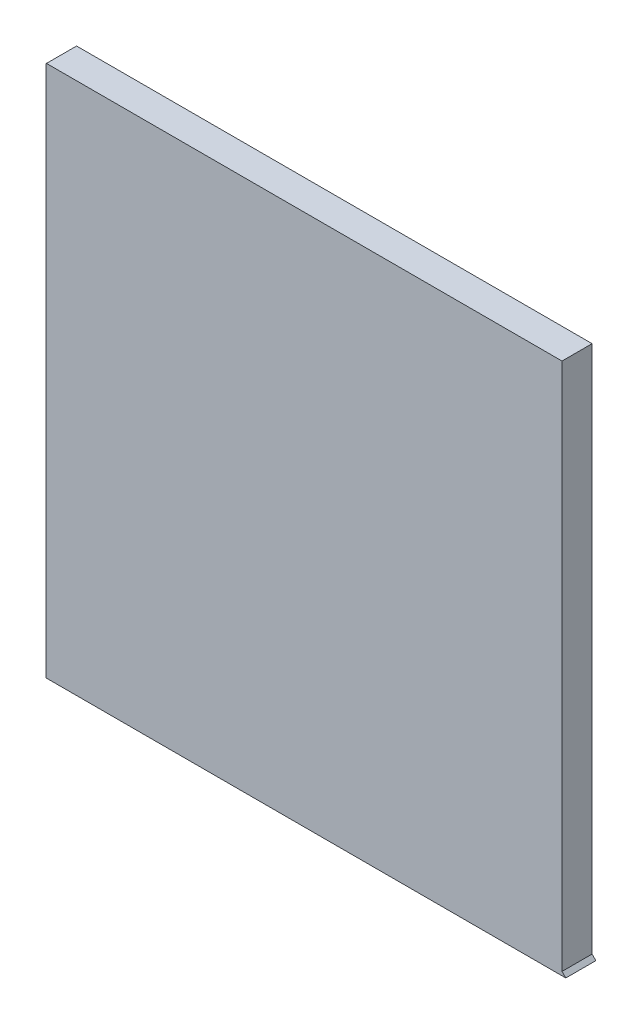
ISO-10303-21;
HEADER;
FILE_DESCRIPTION(('STEP AP214'),'2;1');
FILE_NAME('part.step','',(''),(''),'','','');
FILE_SCHEMA(('AUTOMOTIVE_DESIGN { 1 0 10303 214 1 1 1 1 }'));
ENDSEC;
DATA;
#1=APPLICATION_CONTEXT('core data for automotive mechanical design processes');
#2=APPLICATION_PROTOCOL_DEFINITION('international standard','automotive_design',2000,#1);
#3=PRODUCT_CONTEXT('',#1,'mechanical');
#4=PRODUCT('Part','Part','',(#3));
#5=PRODUCT_RELATED_PRODUCT_CATEGORY('part','',(#4));
#6=PRODUCT_DEFINITION_FORMATION('','',#4);
#7=PRODUCT_DEFINITION_CONTEXT('part definition',#1,'design');
#8=PRODUCT_DEFINITION('design','',#6,#7);
#9=PRODUCT_DEFINITION_SHAPE('','',#8);
#10=(LENGTH_UNIT() NAMED_UNIT(*) SI_UNIT(.MILLI.,.METRE.));
#11=(NAMED_UNIT(*) PLANE_ANGLE_UNIT() SI_UNIT($,.RADIAN.));
#12=(NAMED_UNIT(*) SI_UNIT($,.STERADIAN.) SOLID_ANGLE_UNIT());
#13=UNCERTAINTY_MEASURE_WITH_UNIT(LENGTH_MEASURE(1.E-05),#10,'distance_accuracy_value','');
#14=(GEOMETRIC_REPRESENTATION_CONTEXT(3) GLOBAL_UNCERTAINTY_ASSIGNED_CONTEXT((#13)) GLOBAL_UNIT_ASSIGNED_CONTEXT((#10,
#11,#12)) REPRESENTATION_CONTEXT('',''));
#15=CARTESIAN_POINT('',(0.,0.,0.));
#16=DIRECTION('',(0.,0.,1.));
#17=DIRECTION('',(1.,0.,0.));
#18=AXIS2_PLACEMENT_3D('',#15,#16,#17);
#19=CARTESIAN_POINT('',(-10.358755,10.59688,0.));
#20=DIRECTION('',(-0.707106781187048,0.707106781186048,0.));
#21=DIRECTION('',(0.707106781186048,0.707106781187048,0.));
#22=AXIS2_PLACEMENT_3D('',#19,#20,#21);
#23=PLANE('',#22);
#24=DIRECTION('',(0.,0.,1.));
#25=VECTOR('',#24,1.);
#26=CARTESIAN_POINT('',(-10.358755,10.59688,0.));
#27=LINE('',#26,#25);
#28=CARTESIAN_POINT('',(-10.358755,10.59688,0.));
#29=VERTEX_POINT('',#28);
#30=CARTESIAN_POINT('',(-10.358755,10.59688,1.20000014));
#31=VERTEX_POINT('',#30);
#32=EDGE_CURVE('E11',#29,#31,#27,.T.);
#33=ORIENTED_EDGE('',*,*,#32,.T.);
#34=DIRECTION('',(0.707106781186048,0.707106781187048,0.));
#35=VECTOR('',#34,1.);
#36=CARTESIAN_POINT('',(-10.358755,10.59688,1.20000014));
#37=LINE('',#36,#35);
#38=CARTESIAN_POINT('',(-10.343515,10.61212,1.20000014));
#39=VERTEX_POINT('',#38);
#40=EDGE_CURVE('E25',#31,#39,#37,.T.);
#41=ORIENTED_EDGE('',*,*,#40,.T.);
#42=DIRECTION('',(0.,0.,1.));
#43=VECTOR('',#42,1.);
#44=CARTESIAN_POINT('',(-10.343515,10.61212,0.));
#45=LINE('',#44,#43);
#46=CARTESIAN_POINT('',(-10.343515,10.61212,0.));
#47=VERTEX_POINT('',#46);
#48=EDGE_CURVE('E88',#47,#39,#45,.T.);
#49=ORIENTED_EDGE('',*,*,#48,.F.);
#50=DIRECTION('',(0.707106781186048,0.707106781187048,0.));
#51=VECTOR('',#50,1.);
#52=CARTESIAN_POINT('',(-10.358755,10.59688,0.));
#53=LINE('',#52,#51);
#54=EDGE_CURVE('E131',#29,#47,#53,.T.);
#55=ORIENTED_EDGE('',*,*,#54,.F.);
#56=EDGE_LOOP('',(#33,#41,#49,#55));
#57=FACE_BOUND('',#56,.T.);
#58=ADVANCED_FACE('F17',(#57),#23,.T.);
#59=CARTESIAN_POINT('',(-0.04790827028412,-0.02814532775128,0.));
#60=DIRECTION('',(0.,0.,-1.));
#61=DIRECTION('',(-1.,0.,0.));
#62=AXIS2_PLACEMENT_3D('',#59,#60,#61);
#63=PLANE('',#62);
#64=ORIENTED_EDGE('',*,*,#54,.T.);
#65=DIRECTION('',(1.,0.,0.));
#66=VECTOR('',#65,1.);
#67=CARTESIAN_POINT('',(-10.343515,10.61212,0.));
#68=LINE('',#67,#66);
#69=CARTESIAN_POINT('',(10.207625,10.61212,0.));
#70=VERTEX_POINT('',#69);
#71=EDGE_CURVE('E127',#47,#70,#68,.T.);
#72=ORIENTED_EDGE('',*,*,#71,.T.);
#73=DIRECTION('',(0.,-1.,0.));
#74=VECTOR('',#73,1.);
#75=CARTESIAN_POINT('',(10.207625,10.61212,0.));
#76=LINE('',#75,#74);
#77=CARTESIAN_POINT('',(10.207625,-10.46099,0.));
#78=VERTEX_POINT('',#77);
#79=EDGE_CURVE('E82',#70,#78,#76,.T.);
#80=ORIENTED_EDGE('',*,*,#79,.T.);
#81=DIRECTION('',(0.707106781186548,-0.707106781186548,0.));
#82=VECTOR('',#81,1.);
#83=CARTESIAN_POINT('',(10.207625,-10.46099,0.));
#84=LINE('',#83,#82);
#85=CARTESIAN_POINT('',(10.358755,-10.61212,0.));
#86=VERTEX_POINT('',#85);
#87=EDGE_CURVE('E120',#78,#86,#84,.T.);
#88=ORIENTED_EDGE('',*,*,#87,.T.);
#89=DIRECTION('',(-1.,0.,0.));
#90=VECTOR('',#89,1.);
#91=CARTESIAN_POINT('',(10.358755,-10.61212,0.));
#92=LINE('',#91,#90);
#93=CARTESIAN_POINT('',(-10.358755,-10.61212,0.));
#94=VERTEX_POINT('',#93);
#95=EDGE_CURVE('E116',#86,#94,#92,.T.);
#96=ORIENTED_EDGE('',*,*,#95,.T.);
#97=DIRECTION('',(0.,1.,0.));
#98=VECTOR('',#97,1.);
#99=CARTESIAN_POINT('',(-10.358755,-10.61212,0.));
#100=LINE('',#99,#98);
#101=EDGE_CURVE('E111',#94,#29,#100,.T.);
#102=ORIENTED_EDGE('',*,*,#101,.T.);
#103=EDGE_LOOP('',(#64,#72,#80,#88,#96,#102));
#104=FACE_BOUND('',#103,.T.);
#105=ADVANCED_FACE('F144',(#104),#63,.T.);
#106=CARTESIAN_POINT('',(-10.358755,-10.61212,0.));
#107=DIRECTION('',(-1.,0.,0.));
#108=DIRECTION('',(0.,1.,0.));
#109=AXIS2_PLACEMENT_3D('',#106,#107,#108);
#110=PLANE('',#109);
#111=DIRECTION('',(0.,0.,1.));
#112=VECTOR('',#111,1.);
#113=CARTESIAN_POINT('',(-10.358755,-10.61212,0.));
#114=LINE('',#113,#112);
#115=CARTESIAN_POINT('',(-10.358755,-10.61212,1.20000014));
#116=VERTEX_POINT('',#115);
#117=EDGE_CURVE('E107',#94,#116,#114,.T.);
#118=ORIENTED_EDGE('',*,*,#117,.T.);
#119=DIRECTION('',(0.,1.,0.));
#120=VECTOR('',#119,1.);
#121=CARTESIAN_POINT('',(-10.358755,-10.61212,1.20000014));
#122=LINE('',#121,#120);
#123=EDGE_CURVE('E103',#116,#31,#122,.T.);
#124=ORIENTED_EDGE('',*,*,#123,.T.);
#125=ORIENTED_EDGE('',*,*,#32,.F.);
#126=ORIENTED_EDGE('',*,*,#101,.F.);
#127=EDGE_LOOP('',(#118,#124,#125,#126));
#128=FACE_BOUND('',#127,.T.);
#129=ADVANCED_FACE('F151',(#128),#110,.T.);
#130=CARTESIAN_POINT('',(-0.04790827028412,-0.02814532775128,1.20000014));
#131=DIRECTION('',(0.,0.,-1.));
#132=DIRECTION('',(-1.,0.,0.));
#133=AXIS2_PLACEMENT_3D('',#130,#131,#132);
#134=PLANE('',#133);
#135=ORIENTED_EDGE('',*,*,#123,.F.);
#136=DIRECTION('',(-1.,0.,0.));
#137=VECTOR('',#136,1.);
#138=CARTESIAN_POINT('',(10.358755,-10.61212,1.20000014));
#139=LINE('',#138,#137);
#140=CARTESIAN_POINT('',(10.358755,-10.61212,1.20000014));
#141=VERTEX_POINT('',#140);
#142=EDGE_CURVE('E98',#141,#116,#139,.T.);
#143=ORIENTED_EDGE('',*,*,#142,.F.);
#144=DIRECTION('',(0.707106781186548,-0.707106781186548,0.));
#145=VECTOR('',#144,1.);
#146=CARTESIAN_POINT('',(10.207625,-10.46099,1.20000014));
#147=LINE('',#146,#145);
#148=CARTESIAN_POINT('',(10.207625,-10.46099,1.20000014));
#149=VERTEX_POINT('',#148);
#150=EDGE_CURVE('E73',#149,#141,#147,.T.);
#151=ORIENTED_EDGE('',*,*,#150,.F.);
#152=DIRECTION('',(0.,-1.,0.));
#153=VECTOR('',#152,1.);
#154=CARTESIAN_POINT('',(10.207625,10.61212,1.20000014));
#155=LINE('',#154,#153);
#156=CARTESIAN_POINT('',(10.207625,10.61212,1.20000014));
#157=VERTEX_POINT('',#156);
#158=EDGE_CURVE('E65',#157,#149,#155,.T.);
#159=ORIENTED_EDGE('',*,*,#158,.F.);
#160=DIRECTION('',(1.,0.,0.));
#161=VECTOR('',#160,1.);
#162=CARTESIAN_POINT('',(-10.343515,10.61212,1.20000014));
#163=LINE('',#162,#161);
#164=EDGE_CURVE('E70',#39,#157,#163,.T.);
#165=ORIENTED_EDGE('',*,*,#164,.F.);
#166=ORIENTED_EDGE('',*,*,#40,.F.);
#167=EDGE_LOOP('',(#135,#143,#151,#159,#165,#166));
#168=FACE_BOUND('',#167,.T.);
#169=ADVANCED_FACE('F68',(#168),#134,.F.);
#170=CARTESIAN_POINT('',(-10.343515,10.61212,0.));
#171=DIRECTION('',(0.,1.,0.));
#172=DIRECTION('',(1.,0.,0.));
#173=AXIS2_PLACEMENT_3D('',#170,#171,#172);
#174=PLANE('',#173);
#175=ORIENTED_EDGE('',*,*,#48,.T.);
#176=ORIENTED_EDGE('',*,*,#164,.T.);
#177=DIRECTION('',(0.,0.,1.));
#178=VECTOR('',#177,1.);
#179=CARTESIAN_POINT('',(10.207625,10.61212,0.));
#180=LINE('',#179,#178);
#181=EDGE_CURVE('E80',#70,#157,#180,.T.);
#182=ORIENTED_EDGE('',*,*,#181,.F.);
#183=ORIENTED_EDGE('',*,*,#71,.F.);
#184=EDGE_LOOP('',(#175,#176,#182,#183));
#185=FACE_BOUND('',#184,.T.);
#186=ADVANCED_FACE('F87',(#185),#174,.T.);
#187=CARTESIAN_POINT('',(10.207625,10.61212,0.));
#188=DIRECTION('',(1.,0.,0.));
#189=DIRECTION('',(0.,-1.,0.));
#190=AXIS2_PLACEMENT_3D('',#187,#188,#189);
#191=PLANE('',#190);
#192=ORIENTED_EDGE('',*,*,#181,.T.);
#193=ORIENTED_EDGE('',*,*,#158,.T.);
#194=DIRECTION('',(0.,0.,1.));
#195=VECTOR('',#194,1.);
#196=CARTESIAN_POINT('',(10.207625,-10.46099,0.));
#197=LINE('',#196,#195);
#198=EDGE_CURVE('E85',#78,#149,#197,.T.);
#199=ORIENTED_EDGE('',*,*,#198,.F.);
#200=ORIENTED_EDGE('',*,*,#79,.F.);
#201=EDGE_LOOP('',(#192,#193,#199,#200));
#202=FACE_BOUND('',#201,.T.);
#203=ADVANCED_FACE('F81',(#202),#191,.T.);
#204=CARTESIAN_POINT('',(10.207625,-10.46099,0.));
#205=DIRECTION('',(0.707106781186548,0.707106781186548,0.));
#206=DIRECTION('',(0.707106781186548,-0.707106781186548,0.));
#207=AXIS2_PLACEMENT_3D('',#204,#205,#206);
#208=PLANE('',#207);
#209=ORIENTED_EDGE('',*,*,#198,.T.);
#210=ORIENTED_EDGE('',*,*,#150,.T.);
#211=DIRECTION('',(0.,0.,1.));
#212=VECTOR('',#211,1.);
#213=CARTESIAN_POINT('',(10.358755,-10.61212,0.));
#214=LINE('',#213,#212);
#215=EDGE_CURVE('E178',#86,#141,#214,.T.);
#216=ORIENTED_EDGE('',*,*,#215,.F.);
#217=ORIENTED_EDGE('',*,*,#87,.F.);
#218=EDGE_LOOP('',(#209,#210,#216,#217));
#219=FACE_BOUND('',#218,.T.);
#220=ADVANCED_FACE('F166',(#219),#208,.T.);
#221=CARTESIAN_POINT('',(10.358755,-10.61212,0.));
#222=DIRECTION('',(0.,-1.,0.));
#223=DIRECTION('',(-1.,0.,0.));
#224=AXIS2_PLACEMENT_3D('',#221,#222,#223);
#225=PLANE('',#224);
#226=ORIENTED_EDGE('',*,*,#215,.T.);
#227=ORIENTED_EDGE('',*,*,#142,.T.);
#228=ORIENTED_EDGE('',*,*,#117,.F.);
#229=ORIENTED_EDGE('',*,*,#95,.F.);
#230=EDGE_LOOP('',(#226,#227,#228,#229));
#231=FACE_BOUND('',#230,.T.);
#232=ADVANCED_FACE('F169',(#231),#225,.T.);
#233=CLOSED_SHELL('',(#58,#105,#129,#169,#186,#203,#220,#232));
#234=MANIFOLD_SOLID_BREP('B1',#233);
#235=ADVANCED_BREP_SHAPE_REPRESENTATION('',(#18,#234),#14);
#236=SHAPE_DEFINITION_REPRESENTATION(#9,#235);
ENDSEC;
END-ISO-10303-21;
